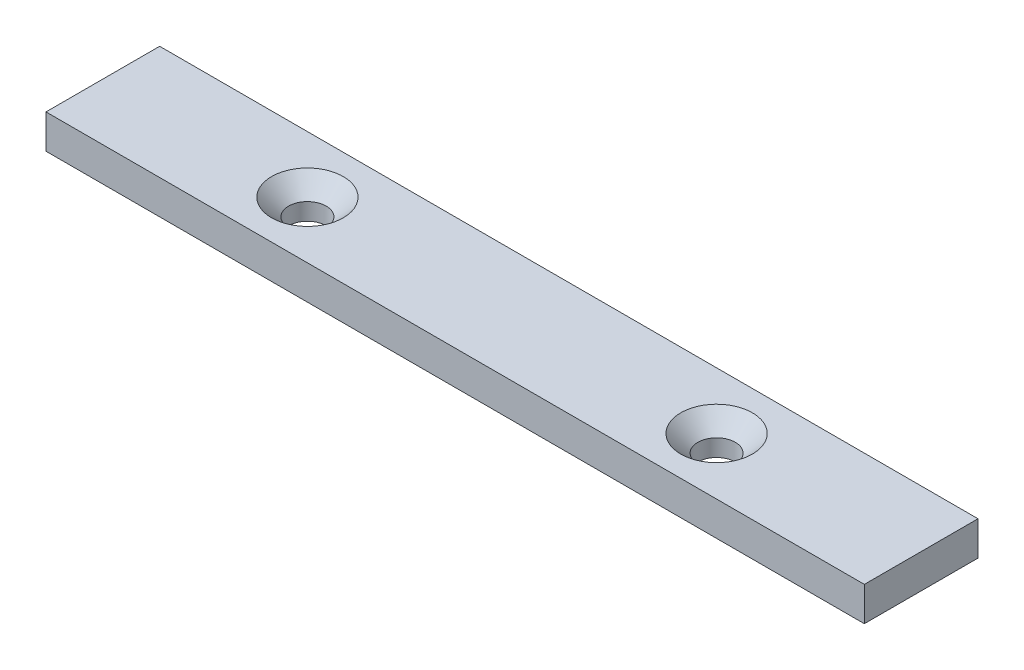
ISO-10303-21;
HEADER;
FILE_DESCRIPTION(('STEP AP214'),'2;1');
FILE_NAME('part.step','',(''),(''),'','','');
FILE_SCHEMA(('AUTOMOTIVE_DESIGN { 1 0 10303 214 1 1 1 1 }'));
ENDSEC;
DATA;
#1=APPLICATION_CONTEXT('core data for automotive mechanical design processes');
#2=APPLICATION_PROTOCOL_DEFINITION('international standard','automotive_design',2000,#1);
#3=PRODUCT_CONTEXT('',#1,'mechanical');
#4=PRODUCT('Part','Part','',(#3));
#5=PRODUCT_RELATED_PRODUCT_CATEGORY('part','',(#4));
#6=PRODUCT_DEFINITION_FORMATION('','',#4);
#7=PRODUCT_DEFINITION_CONTEXT('part definition',#1,'design');
#8=PRODUCT_DEFINITION('design','',#6,#7);
#9=PRODUCT_DEFINITION_SHAPE('','',#8);
#10=(LENGTH_UNIT() NAMED_UNIT(*) SI_UNIT(.MILLI.,.METRE.));
#11=(NAMED_UNIT(*) PLANE_ANGLE_UNIT() SI_UNIT($,.RADIAN.));
#12=(NAMED_UNIT(*) SI_UNIT($,.STERADIAN.) SOLID_ANGLE_UNIT());
#13=UNCERTAINTY_MEASURE_WITH_UNIT(LENGTH_MEASURE(1.E-05),#10,'distance_accuracy_value','');
#14=(GEOMETRIC_REPRESENTATION_CONTEXT(3) GLOBAL_UNCERTAINTY_ASSIGNED_CONTEXT((#13)) GLOBAL_UNIT_ASSIGNED_CONTEXT((#10,
#11,#12)) REPRESENTATION_CONTEXT('',''));
#15=CARTESIAN_POINT('',(0.,0.,0.));
#16=DIRECTION('',(0.,0.,1.));
#17=DIRECTION('',(1.,0.,0.));
#18=AXIS2_PLACEMENT_3D('',#15,#16,#17);
#19=CARTESIAN_POINT('',(-73.8118905316137,6.,17.9251336898396));
#20=DIRECTION('',(1.,0.,0.));
#21=DIRECTION('',(0.,0.,-1.));
#22=AXIS2_PLACEMENT_3D('',#19,#20,#21);
#23=PLANE('',#22);
#24=DIRECTION('',(0.,0.,1.));
#25=VECTOR('',#24,1.);
#26=CARTESIAN_POINT('',(-73.8118905316137,0.,17.9251336898396));
#27=LINE('',#26,#25);
#28=CARTESIAN_POINT('',(-73.8118905316137,0.,17.9251336898396));
#29=VERTEX_POINT('',#28);
#30=CARTESIAN_POINT('',(-73.8118905316137,0.,37.9251336898396));
#31=VERTEX_POINT('',#30);
#32=EDGE_CURVE('E103',#29,#31,#27,.T.);
#33=ORIENTED_EDGE('',*,*,#32,.T.);
#34=DIRECTION('',(0.,-1.,0.));
#35=VECTOR('',#34,1.);
#36=CARTESIAN_POINT('',(-73.8118905316137,6.,37.9251336898396));
#37=LINE('',#36,#35);
#38=CARTESIAN_POINT('',(-73.8118905316137,6.,37.9251336898396));
#39=VERTEX_POINT('',#38);
#40=EDGE_CURVE('E11',#39,#31,#37,.T.);
#41=ORIENTED_EDGE('',*,*,#40,.F.);
#42=DIRECTION('',(0.,0.,1.));
#43=VECTOR('',#42,1.);
#44=CARTESIAN_POINT('',(-73.8118905316137,6.,17.9251336898396));
#45=LINE('',#44,#43);
#46=CARTESIAN_POINT('',(-73.8118905316137,6.,17.9251336898396));
#47=VERTEX_POINT('',#46);
#48=EDGE_CURVE('E91',#47,#39,#45,.T.);
#49=ORIENTED_EDGE('',*,*,#48,.F.);
#50=DIRECTION('',(0.,-1.,0.));
#51=VECTOR('',#50,1.);
#52=CARTESIAN_POINT('',(-73.8118905316137,6.,17.9251336898396));
#53=LINE('',#52,#51);
#54=EDGE_CURVE('E99',#47,#29,#53,.T.);
#55=ORIENTED_EDGE('',*,*,#54,.T.);
#56=EDGE_LOOP('',(#33,#41,#49,#55));
#57=FACE_BOUND('',#56,.T.);
#58=ADVANCED_FACE('F40',(#57),#23,.F.);
#59=CARTESIAN_POINT('',(-73.8118905316137,6.,37.9251336898396));
#60=DIRECTION('',(0.,0.,-1.));
#61=DIRECTION('',(-1.,0.,0.));
#62=AXIS2_PLACEMENT_3D('',#59,#60,#61);
#63=PLANE('',#62);
#64=DIRECTION('',(1.,0.,0.));
#65=VECTOR('',#64,1.);
#66=CARTESIAN_POINT('',(-73.8118905316137,0.,37.9251336898396));
#67=LINE('',#66,#65);
#68=CARTESIAN_POINT('',(70.1881094683862,0.,37.9251336898396));
#69=VERTEX_POINT('',#68);
#70=EDGE_CURVE('E95',#31,#69,#67,.T.);
#71=ORIENTED_EDGE('',*,*,#70,.T.);
#72=DIRECTION('',(0.,-1.,0.));
#73=VECTOR('',#72,1.);
#74=CARTESIAN_POINT('',(70.1881094683862,6.,37.9251336898396));
#75=LINE('',#74,#73);
#76=CARTESIAN_POINT('',(70.1881094683862,6.,37.9251336898396));
#77=VERTEX_POINT('',#76);
#78=EDGE_CURVE('E48',#77,#69,#75,.T.);
#79=ORIENTED_EDGE('',*,*,#78,.F.);
#80=DIRECTION('',(1.,0.,0.));
#81=VECTOR('',#80,1.);
#82=CARTESIAN_POINT('',(-73.8118905316137,6.,37.9251336898396));
#83=LINE('',#82,#81);
#84=EDGE_CURVE('E86',#39,#77,#83,.T.);
#85=ORIENTED_EDGE('',*,*,#84,.F.);
#86=ORIENTED_EDGE('',*,*,#40,.T.);
#87=EDGE_LOOP('',(#71,#79,#85,#86));
#88=FACE_BOUND('',#87,.T.);
#89=ADVANCED_FACE('F94',(#88),#63,.F.);
#90=CARTESIAN_POINT('',(70.1881094683862,6.,37.9251336898396));
#91=DIRECTION('',(-1.,0.,0.));
#92=DIRECTION('',(0.,0.,1.));
#93=AXIS2_PLACEMENT_3D('',#90,#91,#92);
#94=PLANE('',#93);
#95=DIRECTION('',(0.,0.,-1.));
#96=VECTOR('',#95,1.);
#97=CARTESIAN_POINT('',(70.1881094683862,0.,37.9251336898396));
#98=LINE('',#97,#96);
#99=CARTESIAN_POINT('',(70.1881094683862,0.,17.9251336898396));
#100=VERTEX_POINT('',#99);
#101=EDGE_CURVE('E73',#69,#100,#98,.T.);
#102=ORIENTED_EDGE('',*,*,#101,.T.);
#103=DIRECTION('',(0.,-1.,0.));
#104=VECTOR('',#103,1.);
#105=CARTESIAN_POINT('',(70.1881094683862,6.,17.9251336898396));
#106=LINE('',#105,#104);
#107=CARTESIAN_POINT('',(70.1881094683862,6.,17.9251336898396));
#108=VERTEX_POINT('',#107);
#109=EDGE_CURVE('E96',#108,#100,#106,.T.);
#110=ORIENTED_EDGE('',*,*,#109,.F.);
#111=DIRECTION('',(0.,0.,-1.));
#112=VECTOR('',#111,1.);
#113=CARTESIAN_POINT('',(70.1881094683862,6.,37.9251336898396));
#114=LINE('',#113,#112);
#115=EDGE_CURVE('E89',#77,#108,#114,.T.);
#116=ORIENTED_EDGE('',*,*,#115,.F.);
#117=ORIENTED_EDGE('',*,*,#78,.T.);
#118=EDGE_LOOP('',(#102,#110,#116,#117));
#119=FACE_BOUND('',#118,.T.);
#120=ADVANCED_FACE('F97',(#119),#94,.F.);
#121=CARTESIAN_POINT('',(70.1881094683862,6.,17.9251336898396));
#122=DIRECTION('',(0.,0.,1.));
#123=DIRECTION('',(1.,0.,0.));
#124=AXIS2_PLACEMENT_3D('',#121,#122,#123);
#125=PLANE('',#124);
#126=DIRECTION('',(-1.,0.,0.));
#127=VECTOR('',#126,1.);
#128=CARTESIAN_POINT('',(70.1881094683862,0.,17.9251336898396));
#129=LINE('',#128,#127);
#130=EDGE_CURVE('E79',#100,#29,#129,.T.);
#131=ORIENTED_EDGE('',*,*,#130,.T.);
#132=ORIENTED_EDGE('',*,*,#54,.F.);
#133=DIRECTION('',(-1.,0.,0.));
#134=VECTOR('',#133,1.);
#135=CARTESIAN_POINT('',(70.1881094683862,6.,17.9251336898396));
#136=LINE('',#135,#134);
#137=EDGE_CURVE('E56',#108,#47,#136,.T.);
#138=ORIENTED_EDGE('',*,*,#137,.F.);
#139=ORIENTED_EDGE('',*,*,#109,.T.);
#140=EDGE_LOOP('',(#131,#132,#138,#139));
#141=FACE_BOUND('',#140,.T.);
#142=ADVANCED_FACE('F111',(#141),#125,.F.);
#143=CARTESIAN_POINT('',(0.,6.,0.));
#144=DIRECTION('',(0.,1.,0.));
#145=DIRECTION('',(0.,0.,1.));
#146=AXIS2_PLACEMENT_3D('',#143,#144,#145);
#147=PLANE('',#146);
#148=CARTESIAN_POINT('',(-37.8118905316137,6.,27.9251336898396));
#149=DIRECTION('',(0.,1.,0.));
#150=DIRECTION('',(0.,0.,1.));
#151=AXIS2_PLACEMENT_3D('',#148,#149,#150);
#152=CIRCLE('',#151,6.3);
#153=CARTESIAN_POINT('',(-37.8118905316137,6.,34.2251336898396));
#154=VERTEX_POINT('',#153);
#155=EDGE_CURVE('E131',#154,#154,#152,.T.);
#156=ORIENTED_EDGE('',*,*,#155,.F.);
#157=EDGE_LOOP('',(#156));
#158=FACE_BOUND('',#157,.T.);
#159=CARTESIAN_POINT('',(34.1881094683863,6.,27.9251336898396));
#160=DIRECTION('',(0.,1.,0.));
#161=DIRECTION('',(0.,0.,1.));
#162=AXIS2_PLACEMENT_3D('',#159,#160,#161);
#163=CIRCLE('',#162,6.3);
#164=CARTESIAN_POINT('',(34.1881094683863,6.,34.2251336898396));
#165=VERTEX_POINT('',#164);
#166=EDGE_CURVE('E122',#165,#165,#163,.T.);
#167=ORIENTED_EDGE('',*,*,#166,.F.);
#168=EDGE_LOOP('',(#167));
#169=FACE_BOUND('',#168,.T.);
#170=ORIENTED_EDGE('',*,*,#48,.T.);
#171=ORIENTED_EDGE('',*,*,#84,.T.);
#172=ORIENTED_EDGE('',*,*,#115,.T.);
#173=ORIENTED_EDGE('',*,*,#137,.T.);
#174=EDGE_LOOP('',(#170,#171,#172,#173));
#175=FACE_BOUND('',#174,.T.);
#176=ADVANCED_FACE('F87',(#158,#169,#175),#147,.T.);
#177=CARTESIAN_POINT('',(0.,0.,0.));
#178=DIRECTION('',(0.,1.,0.));
#179=DIRECTION('',(0.,0.,1.));
#180=AXIS2_PLACEMENT_3D('',#177,#178,#179);
#181=PLANE('',#180);
#182=CARTESIAN_POINT('',(-37.8118905316137,0.,27.9251336898396));
#183=DIRECTION('',(0.,1.,0.));
#184=DIRECTION('',(0.,0.,1.));
#185=AXIS2_PLACEMENT_3D('',#182,#183,#184);
#186=CIRCLE('',#185,3.3);
#187=CARTESIAN_POINT('',(-37.8118905316137,0.,31.2251336898396));
#188=VERTEX_POINT('',#187);
#189=EDGE_CURVE('E125',#188,#188,#186,.T.);
#190=ORIENTED_EDGE('',*,*,#189,.T.);
#191=EDGE_LOOP('',(#190));
#192=FACE_BOUND('',#191,.T.);
#193=CARTESIAN_POINT('',(34.1881094683863,0.,27.9251336898396));
#194=DIRECTION('',(0.,1.,0.));
#195=DIRECTION('',(0.,0.,1.));
#196=AXIS2_PLACEMENT_3D('',#193,#194,#195);
#197=CIRCLE('',#196,3.3);
#198=CARTESIAN_POINT('',(34.1881094683863,0.,31.2251336898396));
#199=VERTEX_POINT('',#198);
#200=EDGE_CURVE('E106',#199,#199,#197,.T.);
#201=ORIENTED_EDGE('',*,*,#200,.T.);
#202=EDGE_LOOP('',(#201));
#203=FACE_BOUND('',#202,.T.);
#204=ORIENTED_EDGE('',*,*,#32,.F.);
#205=ORIENTED_EDGE('',*,*,#130,.F.);
#206=ORIENTED_EDGE('',*,*,#101,.F.);
#207=ORIENTED_EDGE('',*,*,#70,.F.);
#208=EDGE_LOOP('',(#204,#205,#206,#207));
#209=FACE_BOUND('',#208,.T.);
#210=ADVANCED_FACE('F114',(#192,#203,#209),#181,.F.);
#211=CARTESIAN_POINT('',(34.1881094683863,6.,27.9251336898396));
#212=DIRECTION('',(0.,1.,0.));
#213=DIRECTION('',(0.,0.,1.));
#214=AXIS2_PLACEMENT_3D('',#211,#212,#213);
#215=CYLINDRICAL_SURFACE('',#214,3.3);
#216=ORIENTED_EDGE('',*,*,#200,.F.);
#217=EDGE_LOOP('',(#216));
#218=FACE_BOUND('',#217,.T.);
#219=CARTESIAN_POINT('',(34.1881094683863,3.00000000000001,27.9251336898396));
#220=DIRECTION('',(0.,1.,0.));
#221=DIRECTION('',(0.,0.,1.));
#222=AXIS2_PLACEMENT_3D('',#219,#220,#221);
#223=CIRCLE('',#222,3.3);
#224=CARTESIAN_POINT('',(34.1881094683863,3.00000000000001,31.2251336898396));
#225=VERTEX_POINT('',#224);
#226=EDGE_CURVE('E119',#225,#225,#223,.T.);
#227=ORIENTED_EDGE('',*,*,#226,.T.);
#228=EDGE_LOOP('',(#227));
#229=FACE_BOUND('',#228,.T.);
#230=ADVANCED_FACE('F145',(#218,#229),#215,.F.);
#231=CARTESIAN_POINT('',(34.1881094683863,6.,27.9251336898396));
#232=DIRECTION('',(0.,1.,0.));
#233=DIRECTION('',(0.,0.,1.));
#234=AXIS2_PLACEMENT_3D('',#231,#232,#233);
#235=CONICAL_SURFACE('',#234,6.3,0.78539816339745);
#236=ORIENTED_EDGE('',*,*,#226,.F.);
#237=EDGE_LOOP('',(#236));
#238=FACE_BOUND('',#237,.T.);
#239=ORIENTED_EDGE('',*,*,#166,.T.);
#240=EDGE_LOOP('',(#239));
#241=FACE_BOUND('',#240,.T.);
#242=ADVANCED_FACE('F142',(#238,#241),#235,.F.);
#243=CARTESIAN_POINT('',(-37.8118905316137,6.,27.9251336898396));
#244=DIRECTION('',(0.,1.,0.));
#245=DIRECTION('',(0.,0.,1.));
#246=AXIS2_PLACEMENT_3D('',#243,#244,#245);
#247=CYLINDRICAL_SURFACE('',#246,3.3);
#248=ORIENTED_EDGE('',*,*,#189,.F.);
#249=EDGE_LOOP('',(#248));
#250=FACE_BOUND('',#249,.T.);
#251=CARTESIAN_POINT('',(-37.8118905316137,3.00000000000001,27.9251336898396));
#252=DIRECTION('',(0.,1.,0.));
#253=DIRECTION('',(0.,0.,1.));
#254=AXIS2_PLACEMENT_3D('',#251,#252,#253);
#255=CIRCLE('',#254,3.3);
#256=CARTESIAN_POINT('',(-37.8118905316137,3.00000000000001,31.2251336898396));
#257=VERTEX_POINT('',#256);
#258=EDGE_CURVE('E128',#257,#257,#255,.T.);
#259=ORIENTED_EDGE('',*,*,#258,.T.);
#260=EDGE_LOOP('',(#259));
#261=FACE_BOUND('',#260,.T.);
#262=ADVANCED_FACE('F144',(#250,#261),#247,.F.);
#263=CARTESIAN_POINT('',(-37.8118905316137,6.,27.9251336898396));
#264=DIRECTION('',(0.,1.,0.));
#265=DIRECTION('',(0.,0.,1.));
#266=AXIS2_PLACEMENT_3D('',#263,#264,#265);
#267=CONICAL_SURFACE('',#266,6.3,0.785398163397449);
#268=ORIENTED_EDGE('',*,*,#258,.F.);
#269=EDGE_LOOP('',(#268));
#270=FACE_BOUND('',#269,.T.);
#271=ORIENTED_EDGE('',*,*,#155,.T.);
#272=EDGE_LOOP('',(#271));
#273=FACE_BOUND('',#272,.T.);
#274=ADVANCED_FACE('F135',(#270,#273),#267,.F.);
#275=CLOSED_SHELL('',(#58,#89,#120,#142,#176,#210,#230,#242,#262,#274));
#276=MANIFOLD_SOLID_BREP('B2',#275);
#277=ADVANCED_BREP_SHAPE_REPRESENTATION('',(#18,#276),#14);
#278=SHAPE_DEFINITION_REPRESENTATION(#9,#277);
ENDSEC;
END-ISO-10303-21;
